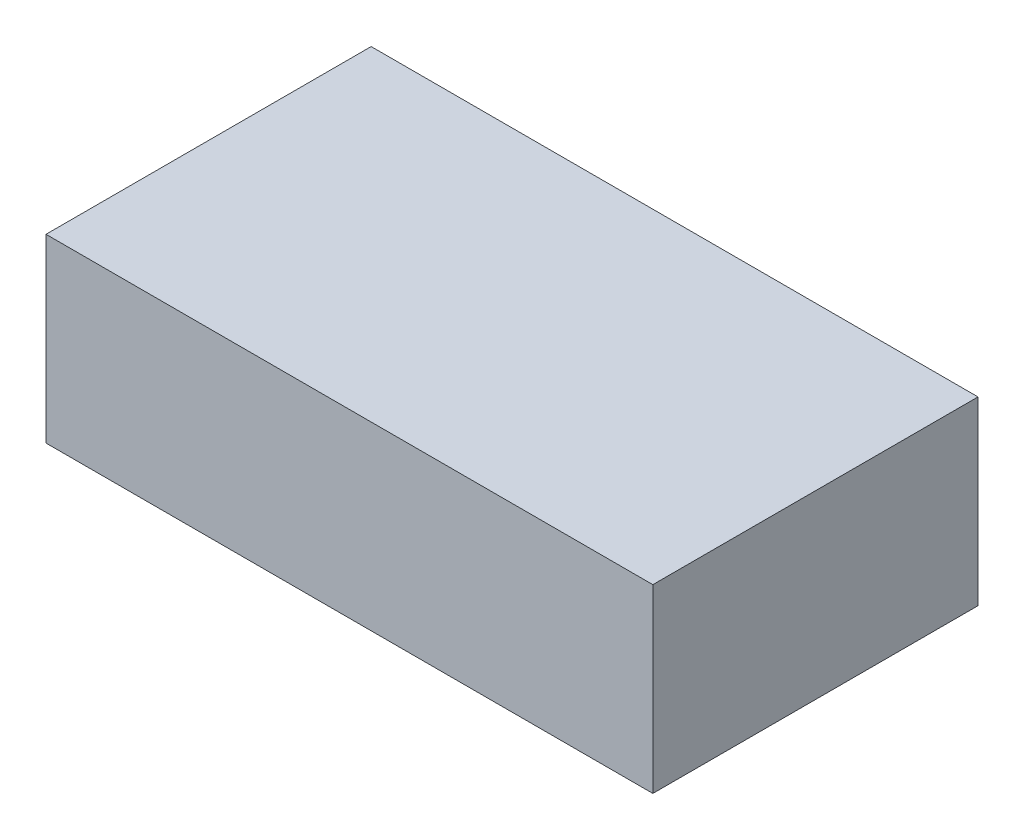
ISO-10303-21;
HEADER;
FILE_DESCRIPTION(('STEP AP214'),'2;1');
FILE_NAME('part.step','',(''),(''),'','','');
FILE_SCHEMA(('AUTOMOTIVE_DESIGN { 1 0 10303 214 1 1 1 1 }'));
ENDSEC;
DATA;
#1=APPLICATION_CONTEXT('core data for automotive mechanical design processes');
#2=APPLICATION_PROTOCOL_DEFINITION('international standard','automotive_design',2000,#1);
#3=PRODUCT_CONTEXT('',#1,'mechanical');
#4=PRODUCT('Part','Part','',(#3));
#5=PRODUCT_RELATED_PRODUCT_CATEGORY('part','',(#4));
#6=PRODUCT_DEFINITION_FORMATION('','',#4);
#7=PRODUCT_DEFINITION_CONTEXT('part definition',#1,'design');
#8=PRODUCT_DEFINITION('design','',#6,#7);
#9=PRODUCT_DEFINITION_SHAPE('','',#8);
#10=(LENGTH_UNIT() NAMED_UNIT(*) SI_UNIT(.MILLI.,.METRE.));
#11=(NAMED_UNIT(*) PLANE_ANGLE_UNIT() SI_UNIT($,.RADIAN.));
#12=(NAMED_UNIT(*) SI_UNIT($,.STERADIAN.) SOLID_ANGLE_UNIT());
#13=UNCERTAINTY_MEASURE_WITH_UNIT(LENGTH_MEASURE(1.E-05),#10,'distance_accuracy_value','');
#14=(GEOMETRIC_REPRESENTATION_CONTEXT(3) GLOBAL_UNCERTAINTY_ASSIGNED_CONTEXT((#13)) GLOBAL_UNIT_ASSIGNED_CONTEXT((#10,
#11,#12)) REPRESENTATION_CONTEXT('',''));
#15=CARTESIAN_POINT('',(0.,0.,0.));
#16=DIRECTION('',(0.,0.,1.));
#17=DIRECTION('',(1.,0.,0.));
#18=AXIS2_PLACEMENT_3D('',#15,#16,#17);
#19=CARTESIAN_POINT('',(0.,2.,0.));
#20=DIRECTION('',(0.,-1.,0.));
#21=DIRECTION('',(0.,0.,-1.));
#22=AXIS2_PLACEMENT_3D('',#19,#20,#21);
#23=PLANE('',#22);
#24=DIRECTION('',(-1.,0.,0.));
#25=VECTOR('',#24,1.);
#26=CARTESIAN_POINT('',(0.,2.,2.));
#27=LINE('',#26,#25);
#28=CARTESIAN_POINT('',(32.9,2.,2.));
#29=VERTEX_POINT('',#28);
#30=CARTESIAN_POINT('',(-2.,2.,2.));
#31=VERTEX_POINT('',#30);
#32=EDGE_CURVE('E137',#29,#31,#27,.T.);
#33=ORIENTED_EDGE('',*,*,#32,.F.);
#34=DIRECTION('',(0.,0.,1.));
#35=VECTOR('',#34,1.);
#36=CARTESIAN_POINT('',(32.9,2.,0.));
#37=LINE('',#36,#35);
#38=CARTESIAN_POINT('',(32.9,2.,-16.7));
#39=VERTEX_POINT('',#38);
#40=EDGE_CURVE('E110',#39,#29,#37,.T.);
#41=ORIENTED_EDGE('',*,*,#40,.F.);
#42=DIRECTION('',(-1.,0.,0.));
#43=VECTOR('',#42,1.);
#44=CARTESIAN_POINT('',(0.,2.,-16.7));
#45=LINE('',#44,#43);
#46=CARTESIAN_POINT('',(-2.,2.,-16.7));
#47=VERTEX_POINT('',#46);
#48=EDGE_CURVE('E123',#39,#47,#45,.T.);
#49=ORIENTED_EDGE('',*,*,#48,.T.);
#50=DIRECTION('',(0.,0.,1.));
#51=VECTOR('',#50,1.);
#52=CARTESIAN_POINT('',(-2.,2.,0.));
#53=LINE('',#52,#51);
#54=EDGE_CURVE('E120',#47,#31,#53,.T.);
#55=ORIENTED_EDGE('',*,*,#54,.T.);
#56=EDGE_LOOP('',(#33,#41,#49,#55));
#57=FACE_BOUND('',#56,.T.);
#58=ADVANCED_FACE('F33',(#57),#23,.F.);
#59=CARTESIAN_POINT('',(30.9,-8.4,0.));
#60=DIRECTION('',(1.,0.,0.));
#61=DIRECTION('',(0.,0.,-1.));
#62=AXIS2_PLACEMENT_3D('',#59,#60,#61);
#63=PLANE('',#62);
#64=DIRECTION('',(0.,0.,-1.));
#65=VECTOR('',#64,1.);
#66=CARTESIAN_POINT('',(30.9,0.,0.));
#67=LINE('',#66,#65);
#68=CARTESIAN_POINT('',(30.9,0.,0.));
#69=VERTEX_POINT('',#68);
#70=CARTESIAN_POINT('',(30.9,0.,-14.7));
#71=VERTEX_POINT('',#70);
#72=EDGE_CURVE('E41',#69,#71,#67,.T.);
#73=ORIENTED_EDGE('',*,*,#72,.T.);
#74=DIRECTION('',(0.,1.,0.));
#75=VECTOR('',#74,1.);
#76=CARTESIAN_POINT('',(30.9,-8.4,-14.7));
#77=LINE('',#76,#75);
#78=CARTESIAN_POINT('',(30.9,-8.4,-14.7));
#79=VERTEX_POINT('',#78);
#80=EDGE_CURVE('E142',#79,#71,#77,.T.);
#81=ORIENTED_EDGE('',*,*,#80,.F.);
#82=DIRECTION('',(0.,0.,-1.));
#83=VECTOR('',#82,1.);
#84=CARTESIAN_POINT('',(30.9,-8.4,0.));
#85=LINE('',#84,#83);
#86=CARTESIAN_POINT('',(30.9,-8.4,0.));
#87=VERTEX_POINT('',#86);
#88=EDGE_CURVE('E129',#87,#79,#85,.T.);
#89=ORIENTED_EDGE('',*,*,#88,.F.);
#90=DIRECTION('',(0.,1.,0.));
#91=VECTOR('',#90,1.);
#92=CARTESIAN_POINT('',(30.9,-8.4,0.));
#93=LINE('',#92,#91);
#94=EDGE_CURVE('E151',#87,#69,#93,.T.);
#95=ORIENTED_EDGE('',*,*,#94,.T.);
#96=EDGE_LOOP('',(#73,#81,#89,#95));
#97=FACE_BOUND('',#96,.T.);
#98=ADVANCED_FACE('F163',(#97),#63,.F.);
#99=CARTESIAN_POINT('',(0.,-8.4,-14.7));
#100=DIRECTION('',(0.,0.,-1.));
#101=DIRECTION('',(-1.,0.,0.));
#102=AXIS2_PLACEMENT_3D('',#99,#100,#101);
#103=PLANE('',#102);
#104=DIRECTION('',(-1.,0.,0.));
#105=VECTOR('',#104,1.);
#106=CARTESIAN_POINT('',(0.,0.,-14.7));
#107=LINE('',#106,#105);
#108=CARTESIAN_POINT('',(0.,0.,-14.7));
#109=VERTEX_POINT('',#108);
#110=EDGE_CURVE('E11',#71,#109,#107,.T.);
#111=ORIENTED_EDGE('',*,*,#110,.T.);
#112=DIRECTION('',(0.,1.,0.));
#113=VECTOR('',#112,1.);
#114=CARTESIAN_POINT('',(0.,-8.4,-14.7));
#115=LINE('',#114,#113);
#116=CARTESIAN_POINT('',(0.,-8.4,-14.7));
#117=VERTEX_POINT('',#116);
#118=EDGE_CURVE('E145',#117,#109,#115,.T.);
#119=ORIENTED_EDGE('',*,*,#118,.F.);
#120=DIRECTION('',(-1.,0.,0.));
#121=VECTOR('',#120,1.);
#122=CARTESIAN_POINT('',(0.,-8.4,-14.7));
#123=LINE('',#122,#121);
#124=EDGE_CURVE('E115',#79,#117,#123,.T.);
#125=ORIENTED_EDGE('',*,*,#124,.F.);
#126=ORIENTED_EDGE('',*,*,#80,.T.);
#127=EDGE_LOOP('',(#111,#119,#125,#126));
#128=FACE_BOUND('',#127,.T.);
#129=ADVANCED_FACE('F167',(#128),#103,.F.);
#130=CARTESIAN_POINT('',(0.,-8.4,0.));
#131=DIRECTION('',(-1.,0.,0.));
#132=DIRECTION('',(0.,0.,1.));
#133=AXIS2_PLACEMENT_3D('',#130,#131,#132);
#134=PLANE('',#133);
#135=DIRECTION('',(0.,0.,1.));
#136=VECTOR('',#135,1.);
#137=CARTESIAN_POINT('',(0.,0.,0.));
#138=LINE('',#137,#136);
#139=CARTESIAN_POINT('',(0.,0.,0.));
#140=VERTEX_POINT('',#139);
#141=EDGE_CURVE('E48',#109,#140,#138,.T.);
#142=ORIENTED_EDGE('',*,*,#141,.T.);
#143=DIRECTION('',(0.,1.,0.));
#144=VECTOR('',#143,1.);
#145=CARTESIAN_POINT('',(0.,-8.4,0.));
#146=LINE('',#145,#144);
#147=CARTESIAN_POINT('',(0.,-8.4,0.));
#148=VERTEX_POINT('',#147);
#149=EDGE_CURVE('E148',#148,#140,#146,.T.);
#150=ORIENTED_EDGE('',*,*,#149,.F.);
#151=DIRECTION('',(0.,0.,1.));
#152=VECTOR('',#151,1.);
#153=CARTESIAN_POINT('',(0.,-8.4,0.));
#154=LINE('',#153,#152);
#155=EDGE_CURVE('E134',#117,#148,#154,.T.);
#156=ORIENTED_EDGE('',*,*,#155,.F.);
#157=ORIENTED_EDGE('',*,*,#118,.T.);
#158=EDGE_LOOP('',(#142,#150,#156,#157));
#159=FACE_BOUND('',#158,.T.);
#160=ADVANCED_FACE('F175',(#159),#134,.F.);
#161=CARTESIAN_POINT('',(0.,-8.4,2.));
#162=DIRECTION('',(0.,0.,-1.));
#163=DIRECTION('',(-1.,0.,0.));
#164=AXIS2_PLACEMENT_3D('',#161,#162,#163);
#165=PLANE('',#164);
#166=ORIENTED_EDGE('',*,*,#32,.T.);
#167=DIRECTION('',(0.,1.,0.));
#168=VECTOR('',#167,1.);
#169=CARTESIAN_POINT('',(-2.,-8.4,2.));
#170=LINE('',#169,#168);
#171=CARTESIAN_POINT('',(-2.,-8.4,2.));
#172=VERTEX_POINT('',#171);
#173=EDGE_CURVE('E118',#172,#31,#170,.T.);
#174=ORIENTED_EDGE('',*,*,#173,.F.);
#175=DIRECTION('',(-1.,0.,0.));
#176=VECTOR('',#175,1.);
#177=CARTESIAN_POINT('',(0.,-8.4,2.));
#178=LINE('',#177,#176);
#179=CARTESIAN_POINT('',(32.9,-8.4,2.));
#180=VERTEX_POINT('',#179);
#181=EDGE_CURVE('E100',#180,#172,#178,.T.);
#182=ORIENTED_EDGE('',*,*,#181,.F.);
#183=DIRECTION('',(0.,1.,0.));
#184=VECTOR('',#183,1.);
#185=CARTESIAN_POINT('',(32.9,-8.4,2.));
#186=LINE('',#185,#184);
#187=EDGE_CURVE('E107',#180,#29,#186,.T.);
#188=ORIENTED_EDGE('',*,*,#187,.T.);
#189=EDGE_LOOP('',(#166,#174,#182,#188));
#190=FACE_BOUND('',#189,.T.);
#191=ADVANCED_FACE('F117',(#190),#165,.F.);
#192=CARTESIAN_POINT('',(-2.,-8.4,0.));
#193=DIRECTION('',(-1.,0.,0.));
#194=DIRECTION('',(0.,0.,1.));
#195=AXIS2_PLACEMENT_3D('',#192,#193,#194);
#196=PLANE('',#195);
#197=ORIENTED_EDGE('',*,*,#54,.F.);
#198=DIRECTION('',(0.,1.,0.));
#199=VECTOR('',#198,1.);
#200=CARTESIAN_POINT('',(-2.,-8.4,-16.7));
#201=LINE('',#200,#199);
#202=CARTESIAN_POINT('',(-2.,-8.4,-16.7));
#203=VERTEX_POINT('',#202);
#204=EDGE_CURVE('E155',#203,#47,#201,.T.);
#205=ORIENTED_EDGE('',*,*,#204,.F.);
#206=DIRECTION('',(0.,0.,1.));
#207=VECTOR('',#206,1.);
#208=CARTESIAN_POINT('',(-2.,-8.4,0.));
#209=LINE('',#208,#207);
#210=EDGE_CURVE('E127',#203,#172,#209,.T.);
#211=ORIENTED_EDGE('',*,*,#210,.T.);
#212=ORIENTED_EDGE('',*,*,#173,.T.);
#213=EDGE_LOOP('',(#197,#205,#211,#212));
#214=FACE_BOUND('',#213,.T.);
#215=ADVANCED_FACE('F182',(#214),#196,.T.);
#216=CARTESIAN_POINT('',(0.,-8.4,-16.7));
#217=DIRECTION('',(0.,0.,-1.));
#218=DIRECTION('',(-1.,0.,0.));
#219=AXIS2_PLACEMENT_3D('',#216,#217,#218);
#220=PLANE('',#219);
#221=ORIENTED_EDGE('',*,*,#48,.F.);
#222=DIRECTION('',(0.,1.,0.));
#223=VECTOR('',#222,1.);
#224=CARTESIAN_POINT('',(32.9,-8.4,-16.7));
#225=LINE('',#224,#223);
#226=CARTESIAN_POINT('',(32.9,-8.4,-16.7));
#227=VERTEX_POINT('',#226);
#228=EDGE_CURVE('E114',#227,#39,#225,.T.);
#229=ORIENTED_EDGE('',*,*,#228,.F.);
#230=DIRECTION('',(-1.,0.,0.));
#231=VECTOR('',#230,1.);
#232=CARTESIAN_POINT('',(0.,-8.4,-16.7));
#233=LINE('',#232,#231);
#234=EDGE_CURVE('E103',#227,#203,#233,.T.);
#235=ORIENTED_EDGE('',*,*,#234,.T.);
#236=ORIENTED_EDGE('',*,*,#204,.T.);
#237=EDGE_LOOP('',(#221,#229,#235,#236));
#238=FACE_BOUND('',#237,.T.);
#239=ADVANCED_FACE('F195',(#238),#220,.T.);
#240=CARTESIAN_POINT('',(32.9,-8.4,0.));
#241=DIRECTION('',(-1.,0.,0.));
#242=DIRECTION('',(0.,0.,1.));
#243=AXIS2_PLACEMENT_3D('',#240,#241,#242);
#244=PLANE('',#243);
#245=ORIENTED_EDGE('',*,*,#40,.T.);
#246=ORIENTED_EDGE('',*,*,#187,.F.);
#247=DIRECTION('',(0.,0.,1.));
#248=VECTOR('',#247,1.);
#249=CARTESIAN_POINT('',(32.9,-8.4,0.));
#250=LINE('',#249,#248);
#251=EDGE_CURVE('E94',#227,#180,#250,.T.);
#252=ORIENTED_EDGE('',*,*,#251,.F.);
#253=ORIENTED_EDGE('',*,*,#228,.T.);
#254=EDGE_LOOP('',(#245,#246,#252,#253));
#255=FACE_BOUND('',#254,.T.);
#256=ADVANCED_FACE('F108',(#255),#244,.F.);
#257=CARTESIAN_POINT('',(0.,-8.4,0.));
#258=DIRECTION('',(0.,0.,1.));
#259=DIRECTION('',(1.,0.,0.));
#260=AXIS2_PLACEMENT_3D('',#257,#258,#259);
#261=PLANE('',#260);
#262=DIRECTION('',(1.,0.,0.));
#263=VECTOR('',#262,1.);
#264=CARTESIAN_POINT('',(0.,0.,0.));
#265=LINE('',#264,#263);
#266=EDGE_CURVE('E159',#140,#69,#265,.T.);
#267=ORIENTED_EDGE('',*,*,#266,.T.);
#268=ORIENTED_EDGE('',*,*,#94,.F.);
#269=DIRECTION('',(1.,0.,0.));
#270=VECTOR('',#269,1.);
#271=CARTESIAN_POINT('',(0.,-8.4,0.));
#272=LINE('',#271,#270);
#273=EDGE_CURVE('E132',#148,#87,#272,.T.);
#274=ORIENTED_EDGE('',*,*,#273,.F.);
#275=ORIENTED_EDGE('',*,*,#149,.T.);
#276=EDGE_LOOP('',(#267,#268,#274,#275));
#277=FACE_BOUND('',#276,.T.);
#278=ADVANCED_FACE('F173',(#277),#261,.F.);
#279=CARTESIAN_POINT('',(0.,-8.4,0.));
#280=DIRECTION('',(0.,1.,0.));
#281=DIRECTION('',(0.,0.,1.));
#282=AXIS2_PLACEMENT_3D('',#279,#280,#281);
#283=PLANE('',#282);
#284=ORIENTED_EDGE('',*,*,#181,.T.);
#285=ORIENTED_EDGE('',*,*,#210,.F.);
#286=ORIENTED_EDGE('',*,*,#234,.F.);
#287=ORIENTED_EDGE('',*,*,#251,.T.);
#288=EDGE_LOOP('',(#284,#285,#286,#287));
#289=FACE_BOUND('',#288,.T.);
#290=ORIENTED_EDGE('',*,*,#88,.T.);
#291=ORIENTED_EDGE('',*,*,#124,.T.);
#292=ORIENTED_EDGE('',*,*,#155,.T.);
#293=ORIENTED_EDGE('',*,*,#273,.T.);
#294=EDGE_LOOP('',(#290,#291,#292,#293));
#295=FACE_BOUND('',#294,.T.);
#296=ADVANCED_FACE('F96',(#289,#295),#283,.F.);
#297=CARTESIAN_POINT('',(0.,0.,0.));
#298=DIRECTION('',(0.,-1.,0.));
#299=DIRECTION('',(0.,0.,-1.));
#300=AXIS2_PLACEMENT_3D('',#297,#298,#299);
#301=PLANE('',#300);
#302=ORIENTED_EDGE('',*,*,#141,.F.);
#303=ORIENTED_EDGE('',*,*,#110,.F.);
#304=ORIENTED_EDGE('',*,*,#72,.F.);
#305=ORIENTED_EDGE('',*,*,#266,.F.);
#306=EDGE_LOOP('',(#302,#303,#304,#305));
#307=FACE_BOUND('',#306,.T.);
#308=ADVANCED_FACE('F35',(#307),#301,.T.);
#309=CLOSED_SHELL('',(#58,#98,#129,#160,#191,#215,#239,#256,#278,#296,#308));
#310=MANIFOLD_SOLID_BREP('B2',#309);
#311=ADVANCED_BREP_SHAPE_REPRESENTATION('',(#18,#310),#14);
#312=SHAPE_DEFINITION_REPRESENTATION(#9,#311);
ENDSEC;
END-ISO-10303-21;
